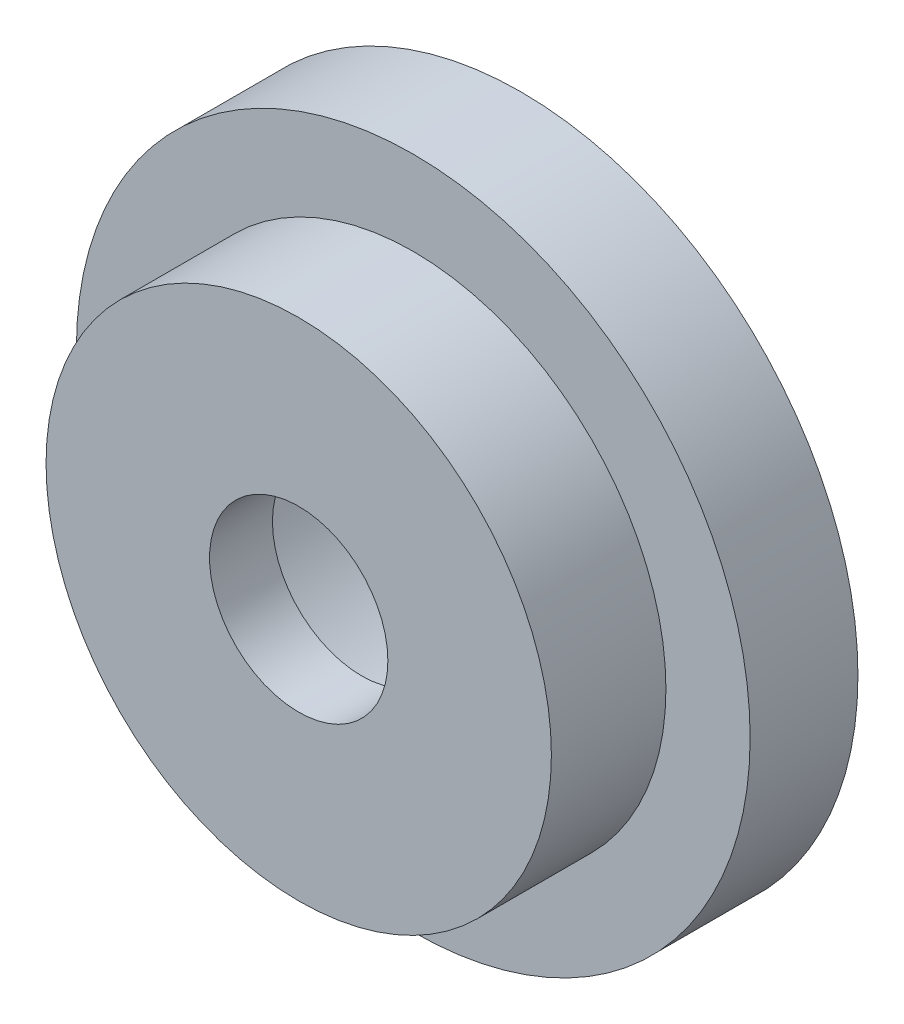
ISO-10303-21;
HEADER;
FILE_DESCRIPTION(('STEP AP214'),'2;1');
FILE_NAME('part.step','',(''),(''),'','','');
FILE_SCHEMA(('AUTOMOTIVE_DESIGN { 1 0 10303 214 1 1 1 1 }'));
ENDSEC;
DATA;
#1=APPLICATION_CONTEXT('core data for automotive mechanical design processes');
#2=APPLICATION_PROTOCOL_DEFINITION('international standard','automotive_design',2000,#1);
#3=PRODUCT_CONTEXT('',#1,'mechanical');
#4=PRODUCT('Part','Part','',(#3));
#5=PRODUCT_RELATED_PRODUCT_CATEGORY('part','',(#4));
#6=PRODUCT_DEFINITION_FORMATION('','',#4);
#7=PRODUCT_DEFINITION_CONTEXT('part definition',#1,'design');
#8=PRODUCT_DEFINITION('design','',#6,#7);
#9=PRODUCT_DEFINITION_SHAPE('','',#8);
#10=(LENGTH_UNIT() NAMED_UNIT(*) SI_UNIT(.MILLI.,.METRE.));
#11=(NAMED_UNIT(*) PLANE_ANGLE_UNIT() SI_UNIT($,.RADIAN.));
#12=(NAMED_UNIT(*) SI_UNIT($,.STERADIAN.) SOLID_ANGLE_UNIT());
#13=UNCERTAINTY_MEASURE_WITH_UNIT(LENGTH_MEASURE(1.E-05),#10,'distance_accuracy_value','');
#14=(GEOMETRIC_REPRESENTATION_CONTEXT(3) GLOBAL_UNCERTAINTY_ASSIGNED_CONTEXT((#13)) GLOBAL_UNIT_ASSIGNED_CONTEXT((#10,
#11,#12)) REPRESENTATION_CONTEXT('',''));
#15=CARTESIAN_POINT('',(0.,0.,0.));
#16=DIRECTION('',(0.,0.,1.));
#17=DIRECTION('',(1.,0.,0.));
#18=AXIS2_PLACEMENT_3D('',#15,#16,#17);
#19=CARTESIAN_POINT('',(0.,0.,0.));
#20=DIRECTION('',(0.,0.,1.));
#21=DIRECTION('',(1.,0.,0.));
#22=AXIS2_PLACEMENT_3D('',#19,#20,#21);
#23=CYLINDRICAL_SURFACE('',#22,5.0419);
#24=CARTESIAN_POINT('',(0.,0.,0.));
#25=DIRECTION('',(0.,0.,1.));
#26=DIRECTION('',(1.,0.,0.));
#27=AXIS2_PLACEMENT_3D('',#24,#25,#26);
#28=CIRCLE('',#27,5.0419);
#29=CARTESIAN_POINT('',(5.0419,0.,0.));
#30=VERTEX_POINT('',#29);
#31=EDGE_CURVE('E59',#30,#30,#28,.T.);
#32=ORIENTED_EDGE('',*,*,#31,.T.);
#33=EDGE_LOOP('',(#32));
#34=FACE_BOUND('',#33,.T.);
#35=CARTESIAN_POINT('',(0.,0.,-3.556));
#36=DIRECTION('',(0.,0.,-1.));
#37=DIRECTION('',(-1.,0.,0.));
#38=AXIS2_PLACEMENT_3D('',#35,#36,#37);
#39=CIRCLE('',#38,5.0419);
#40=CARTESIAN_POINT('',(-5.0419,0.,-3.556));
#41=VERTEX_POINT('',#40);
#42=EDGE_CURVE('E37',#41,#41,#39,.F.);
#43=ORIENTED_EDGE('',*,*,#42,.F.);
#44=EDGE_LOOP('',(#43));
#45=FACE_BOUND('',#44,.T.);
#46=ADVANCED_FACE('F33',(#34,#45),#23,.F.);
#47=CARTESIAN_POINT('',(0.,0.,0.));
#48=DIRECTION('',(0.,0.,-1.));
#49=DIRECTION('',(-1.,0.,0.));
#50=AXIS2_PLACEMENT_3D('',#47,#48,#49);
#51=PLANE('',#50);
#52=ORIENTED_EDGE('',*,*,#31,.F.);
#53=EDGE_LOOP('',(#52));
#54=FACE_BOUND('',#53,.T.);
#55=CARTESIAN_POINT('',(0.,0.,0.));
#56=DIRECTION('',(0.,0.,1.));
#57=DIRECTION('',(1.,0.,0.));
#58=AXIS2_PLACEMENT_3D('',#55,#56,#57);
#59=CIRCLE('',#58,14.2875);
#60=CARTESIAN_POINT('',(14.2875,0.,0.));
#61=VERTEX_POINT('',#60);
#62=EDGE_CURVE('E10',#61,#61,#59,.T.);
#63=ORIENTED_EDGE('',*,*,#62,.T.);
#64=EDGE_LOOP('',(#63));
#65=FACE_BOUND('',#64,.T.);
#66=ADVANCED_FACE('F35',(#54,#65),#51,.F.);
#67=CARTESIAN_POINT('',(0.,0.,13.6967088607595));
#68=DIRECTION('',(0.,0.,1.));
#69=DIRECTION('',(1.,0.,0.));
#70=AXIS2_PLACEMENT_3D('',#67,#68,#69);
#71=CYLINDRICAL_SURFACE('',#70,14.2875);
#72=ORIENTED_EDGE('',*,*,#62,.F.);
#73=EDGE_LOOP('',(#72));
#74=FACE_BOUND('',#73,.T.);
#75=CARTESIAN_POINT('',(0.,0.,-6.477));
#76=DIRECTION('',(0.,0.,1.));
#77=DIRECTION('',(1.,0.,0.));
#78=AXIS2_PLACEMENT_3D('',#75,#76,#77);
#79=CIRCLE('',#78,14.2875);
#80=CARTESIAN_POINT('',(14.2875,0.,-6.477));
#81=VERTEX_POINT('',#80);
#82=EDGE_CURVE('E41',#81,#81,#79,.T.);
#83=ORIENTED_EDGE('',*,*,#82,.T.);
#84=EDGE_LOOP('',(#83));
#85=FACE_BOUND('',#84,.T.);
#86=ADVANCED_FACE('F80',(#74,#85),#71,.T.);
#87=CARTESIAN_POINT('',(0.,14.2875,-6.477));
#88=DIRECTION('',(0.,0.,-1.));
#89=DIRECTION('',(-1.,0.,0.));
#90=AXIS2_PLACEMENT_3D('',#87,#88,#89);
#91=PLANE('',#90);
#92=ORIENTED_EDGE('',*,*,#82,.F.);
#93=EDGE_LOOP('',(#92));
#94=FACE_BOUND('',#93,.T.);
#95=CARTESIAN_POINT('',(0.,0.,-6.477));
#96=DIRECTION('',(0.,0.,1.));
#97=DIRECTION('',(1.,0.,0.));
#98=AXIS2_PLACEMENT_3D('',#95,#96,#97);
#99=CIRCLE('',#98,19.05);
#100=CARTESIAN_POINT('',(19.05,0.,-6.477));
#101=VERTEX_POINT('',#100);
#102=EDGE_CURVE('E45',#101,#101,#99,.T.);
#103=ORIENTED_EDGE('',*,*,#102,.T.);
#104=EDGE_LOOP('',(#103));
#105=FACE_BOUND('',#104,.T.);
#106=ADVANCED_FACE('F101',(#94,#105),#91,.F.);
#107=CARTESIAN_POINT('',(0.,0.,13.6967088607595));
#108=DIRECTION('',(0.,0.,1.));
#109=DIRECTION('',(1.,0.,0.));
#110=AXIS2_PLACEMENT_3D('',#107,#108,#109);
#111=CYLINDRICAL_SURFACE('',#110,19.05);
#112=ORIENTED_EDGE('',*,*,#102,.F.);
#113=EDGE_LOOP('',(#112));
#114=FACE_BOUND('',#113,.T.);
#115=CARTESIAN_POINT('',(0.,0.,-12.573));
#116=DIRECTION('',(0.,0.,1.));
#117=DIRECTION('',(1.,0.,0.));
#118=AXIS2_PLACEMENT_3D('',#115,#116,#117);
#119=CIRCLE('',#118,19.05);
#120=CARTESIAN_POINT('',(19.05,0.,-12.573));
#121=VERTEX_POINT('',#120);
#122=EDGE_CURVE('E50',#121,#121,#119,.T.);
#123=ORIENTED_EDGE('',*,*,#122,.T.);
#124=EDGE_LOOP('',(#123));
#125=FACE_BOUND('',#124,.T.);
#126=ADVANCED_FACE('F97',(#114,#125),#111,.T.);
#127=CARTESIAN_POINT('',(0.,19.05,-12.573));
#128=DIRECTION('',(0.,0.,1.));
#129=DIRECTION('',(1.,0.,0.));
#130=AXIS2_PLACEMENT_3D('',#127,#128,#129);
#131=PLANE('',#130);
#132=ORIENTED_EDGE('',*,*,#122,.F.);
#133=EDGE_LOOP('',(#132));
#134=FACE_BOUND('',#133,.T.);
#135=CARTESIAN_POINT('',(0.,0.,-12.573));
#136=DIRECTION('',(0.,0.,1.));
#137=DIRECTION('',(1.,0.,0.));
#138=AXIS2_PLACEMENT_3D('',#135,#136,#137);
#139=CIRCLE('',#138,14.2875);
#140=CARTESIAN_POINT('',(14.2875,0.,-12.573));
#141=VERTEX_POINT('',#140);
#142=EDGE_CURVE('E53',#141,#141,#139,.T.);
#143=ORIENTED_EDGE('',*,*,#142,.T.);
#144=EDGE_LOOP('',(#143));
#145=FACE_BOUND('',#144,.T.);
#146=ADVANCED_FACE('F93',(#134,#145),#131,.F.);
#147=CARTESIAN_POINT('',(0.,0.,13.6967088607595));
#148=DIRECTION('',(0.,0.,1.));
#149=DIRECTION('',(1.,0.,0.));
#150=AXIS2_PLACEMENT_3D('',#147,#148,#149);
#151=CYLINDRICAL_SURFACE('',#150,14.2875);
#152=ORIENTED_EDGE('',*,*,#142,.F.);
#153=EDGE_LOOP('',(#152));
#154=FACE_BOUND('',#153,.T.);
#155=CARTESIAN_POINT('',(0.,0.,-15.621));
#156=DIRECTION('',(0.,0.,1.));
#157=DIRECTION('',(1.,0.,0.));
#158=AXIS2_PLACEMENT_3D('',#155,#156,#157);
#159=CIRCLE('',#158,14.2875);
#160=CARTESIAN_POINT('',(14.2875,0.,-15.621));
#161=VERTEX_POINT('',#160);
#162=EDGE_CURVE('E56',#161,#161,#159,.T.);
#163=ORIENTED_EDGE('',*,*,#162,.T.);
#164=EDGE_LOOP('',(#163));
#165=FACE_BOUND('',#164,.T.);
#166=ADVANCED_FACE('F89',(#154,#165),#151,.T.);
#167=CARTESIAN_POINT('',(0.,14.2875,-15.621));
#168=DIRECTION('',(0.,0.,1.));
#169=DIRECTION('',(1.,0.,0.));
#170=AXIS2_PLACEMENT_3D('',#167,#168,#169);
#171=PLANE('',#170);
#172=CARTESIAN_POINT('',(0.,0.,-15.621));
#173=DIRECTION('',(0.,0.,-1.));
#174=DIRECTION('',(-1.,0.,0.));
#175=AXIS2_PLACEMENT_3D('',#172,#173,#174);
#176=CIRCLE('',#175,11.1125);
#177=CARTESIAN_POINT('',(-11.1125,0.,-15.621));
#178=VERTEX_POINT('',#177);
#179=EDGE_CURVE('E62',#178,#178,#176,.T.);
#180=ORIENTED_EDGE('',*,*,#179,.F.);
#181=EDGE_LOOP('',(#180));
#182=FACE_BOUND('',#181,.T.);
#183=ORIENTED_EDGE('',*,*,#162,.F.);
#184=EDGE_LOOP('',(#183));
#185=FACE_BOUND('',#184,.T.);
#186=ADVANCED_FACE('F86',(#182,#185),#171,.F.);
#187=CARTESIAN_POINT('',(0.,0.,-3.556));
#188=DIRECTION('',(0.,0.,-1.));
#189=DIRECTION('',(-1.,0.,0.));
#190=AXIS2_PLACEMENT_3D('',#187,#188,#189);
#191=PLANE('',#190);
#192=CARTESIAN_POINT('',(0.,0.,-3.556));
#193=DIRECTION('',(0.,0.,-1.));
#194=DIRECTION('',(-1.,0.,0.));
#195=AXIS2_PLACEMENT_3D('',#192,#193,#194);
#196=CIRCLE('',#195,11.1125);
#197=CARTESIAN_POINT('',(-11.1125,0.,-3.556));
#198=VERTEX_POINT('',#197);
#199=EDGE_CURVE('E65',#198,#198,#196,.T.);
#200=ORIENTED_EDGE('',*,*,#199,.T.);
#201=EDGE_LOOP('',(#200));
#202=FACE_BOUND('',#201,.T.);
#203=ORIENTED_EDGE('',*,*,#42,.T.);
#204=EDGE_LOOP('',(#203));
#205=FACE_BOUND('',#204,.T.);
#206=ADVANCED_FACE('F72',(#202,#205),#191,.T.);
#207=CARTESIAN_POINT('',(0.,0.,-3.556));
#208=DIRECTION('',(0.,0.,-1.));
#209=DIRECTION('',(-1.,0.,0.));
#210=AXIS2_PLACEMENT_3D('',#207,#208,#209);
#211=CYLINDRICAL_SURFACE('',#210,11.1125);
#212=ORIENTED_EDGE('',*,*,#199,.F.);
#213=EDGE_LOOP('',(#212));
#214=FACE_BOUND('',#213,.T.);
#215=ORIENTED_EDGE('',*,*,#179,.T.);
#216=EDGE_LOOP('',(#215));
#217=FACE_BOUND('',#216,.T.);
#218=ADVANCED_FACE('F84',(#214,#217),#211,.F.);
#219=CLOSED_SHELL('',(#46,#66,#86,#106,#126,#146,#166,#186,#206,#218));
#220=MANIFOLD_SOLID_BREP('B2',#219);
#221=ADVANCED_BREP_SHAPE_REPRESENTATION('',(#18,#220),#14);
#222=SHAPE_DEFINITION_REPRESENTATION(#9,#221);
ENDSEC;
END-ISO-10303-21;
